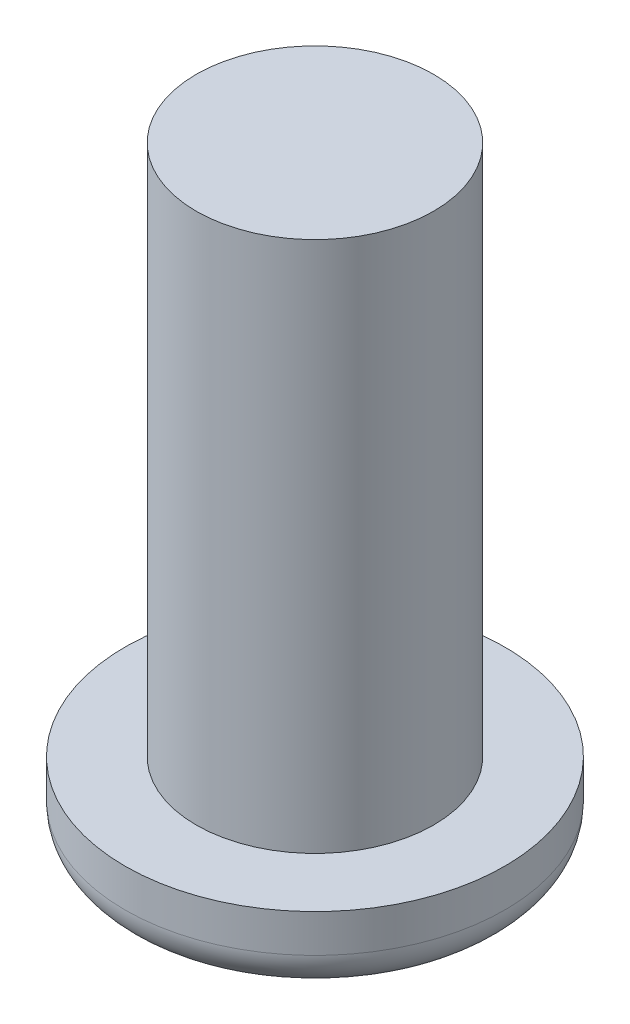
ISO-10303-21;
HEADER;
FILE_DESCRIPTION(('STEP AP214'),'2;1');
FILE_NAME('part.step','',(''),(''),'','','');
FILE_SCHEMA(('AUTOMOTIVE_DESIGN { 1 0 10303 214 1 1 1 1 }'));
ENDSEC;
DATA;
#1=APPLICATION_CONTEXT('core data for automotive mechanical design processes');
#2=APPLICATION_PROTOCOL_DEFINITION('international standard','automotive_design',2000,#1);
#3=PRODUCT_CONTEXT('',#1,'mechanical');
#4=PRODUCT('Part','Part','',(#3));
#5=PRODUCT_RELATED_PRODUCT_CATEGORY('part','',(#4));
#6=PRODUCT_DEFINITION_FORMATION('','',#4);
#7=PRODUCT_DEFINITION_CONTEXT('part definition',#1,'design');
#8=PRODUCT_DEFINITION('design','',#6,#7);
#9=PRODUCT_DEFINITION_SHAPE('','',#8);
#10=(LENGTH_UNIT() NAMED_UNIT(*) SI_UNIT(.MILLI.,.METRE.));
#11=(NAMED_UNIT(*) PLANE_ANGLE_UNIT() SI_UNIT($,.RADIAN.));
#12=(NAMED_UNIT(*) SI_UNIT($,.STERADIAN.) SOLID_ANGLE_UNIT());
#13=UNCERTAINTY_MEASURE_WITH_UNIT(LENGTH_MEASURE(1.E-05),#10,'distance_accuracy_value','');
#14=(GEOMETRIC_REPRESENTATION_CONTEXT(3) GLOBAL_UNCERTAINTY_ASSIGNED_CONTEXT((#13)) GLOBAL_UNIT_ASSIGNED_CONTEXT((#10,
#11,#12)) REPRESENTATION_CONTEXT('',''));
#15=CARTESIAN_POINT('',(0.,0.,0.));
#16=DIRECTION('',(0.,0.,1.));
#17=DIRECTION('',(1.,0.,0.));
#18=AXIS2_PLACEMENT_3D('',#15,#16,#17);
#19=CARTESIAN_POINT('',(0.,2.54,0.));
#20=DIRECTION('',(0.,-1.,0.));
#21=DIRECTION('',(0.,0.,-1.));
#22=AXIS2_PLACEMENT_3D('',#19,#20,#21);
#23=CYLINDRICAL_SURFACE('',#22,6.35);
#24=CARTESIAN_POINT('',(0.,1.27,0.));
#25=DIRECTION('',(0.,1.,0.));
#26=DIRECTION('',(0.,0.,1.));
#27=AXIS2_PLACEMENT_3D('',#24,#25,#26);
#28=CIRCLE('',#27,6.35);
#29=CARTESIAN_POINT('',(0.,1.27,6.35));
#30=VERTEX_POINT('',#29);
#31=EDGE_CURVE('E49',#30,#30,#28,.T.);
#32=ORIENTED_EDGE('',*,*,#31,.T.);
#33=EDGE_LOOP('',(#32));
#34=FACE_BOUND('',#33,.T.);
#35=CARTESIAN_POINT('',(0.,2.54,0.));
#36=DIRECTION('',(0.,1.,0.));
#37=DIRECTION('',(0.,0.,1.));
#38=AXIS2_PLACEMENT_3D('',#35,#36,#37);
#39=CIRCLE('',#38,6.35);
#40=CARTESIAN_POINT('',(0.,2.54,6.35));
#41=VERTEX_POINT('',#40);
#42=EDGE_CURVE('E53',#41,#41,#39,.T.);
#43=ORIENTED_EDGE('',*,*,#42,.F.);
#44=EDGE_LOOP('',(#43));
#45=FACE_BOUND('',#44,.T.);
#46=ADVANCED_FACE('F37',(#34,#45),#23,.T.);
#47=CARTESIAN_POINT('',(0.,2.54,0.));
#48=DIRECTION('',(0.,1.,0.));
#49=DIRECTION('',(0.,0.,1.));
#50=AXIS2_PLACEMENT_3D('',#47,#48,#49);
#51=PLANE('',#50);
#52=CARTESIAN_POINT('',(0.,2.54,0.));
#53=DIRECTION('',(0.,1.,0.));
#54=DIRECTION('',(0.,0.,1.));
#55=AXIS2_PLACEMENT_3D('',#52,#53,#54);
#56=CIRCLE('',#55,3.96875);
#57=CARTESIAN_POINT('',(0.,2.54,3.96875));
#58=VERTEX_POINT('',#57);
#59=EDGE_CURVE('E10',#58,#58,#56,.T.);
#60=ORIENTED_EDGE('',*,*,#59,.F.);
#61=EDGE_LOOP('',(#60));
#62=FACE_BOUND('',#61,.T.);
#63=ORIENTED_EDGE('',*,*,#42,.T.);
#64=EDGE_LOOP('',(#63));
#65=FACE_BOUND('',#64,.T.);
#66=ADVANCED_FACE('F72',(#62,#65),#51,.T.);
#67=CARTESIAN_POINT('',(0.,0.,0.));
#68=DIRECTION('',(0.,1.,0.));
#69=DIRECTION('',(0.,0.,1.));
#70=AXIS2_PLACEMENT_3D('',#67,#68,#69);
#71=PLANE('',#70);
#72=CARTESIAN_POINT('',(0.,0.,0.));
#73=DIRECTION('',(0.,1.,0.));
#74=DIRECTION('',(0.,0.,1.));
#75=AXIS2_PLACEMENT_3D('',#72,#73,#74);
#76=CIRCLE('',#75,5.08);
#77=CARTESIAN_POINT('',(0.,0.,5.08));
#78=VERTEX_POINT('',#77);
#79=EDGE_CURVE('E41',#78,#78,#76,.F.);
#80=ORIENTED_EDGE('',*,*,#79,.T.);
#81=EDGE_LOOP('',(#80));
#82=FACE_BOUND('',#81,.T.);
#83=ADVANCED_FACE('F62',(#82),#71,.F.);
#84=CARTESIAN_POINT('',(0.,1.27,0.));
#85=DIRECTION('',(0.,1.,0.));
#86=DIRECTION('',(0.,0.,1.));
#87=AXIS2_PLACEMENT_3D('',#84,#85,#86);
#88=TOROIDAL_SURFACE('',#87,5.08,1.27);
#89=ORIENTED_EDGE('',*,*,#79,.F.);
#90=EDGE_LOOP('',(#89));
#91=FACE_BOUND('',#90,.T.);
#92=ORIENTED_EDGE('',*,*,#31,.F.);
#93=EDGE_LOOP('',(#92));
#94=FACE_BOUND('',#93,.T.);
#95=ADVANCED_FACE('F39',(#91,#94),#88,.T.);
#96=CARTESIAN_POINT('',(0.,20.32,0.));
#97=DIRECTION('',(0.,-1.,0.));
#98=DIRECTION('',(0.,0.,-1.));
#99=AXIS2_PLACEMENT_3D('',#96,#97,#98);
#100=CYLINDRICAL_SURFACE('',#99,3.96875);
#101=CARTESIAN_POINT('',(0.,20.32,0.));
#102=DIRECTION('',(0.,1.,0.));
#103=DIRECTION('',(0.,0.,1.));
#104=AXIS2_PLACEMENT_3D('',#101,#102,#103);
#105=CIRCLE('',#104,3.96875);
#106=CARTESIAN_POINT('',(0.,20.32,3.96875));
#107=VERTEX_POINT('',#106);
#108=EDGE_CURVE('E52',#107,#107,#105,.T.);
#109=ORIENTED_EDGE('',*,*,#108,.F.);
#110=EDGE_LOOP('',(#109));
#111=FACE_BOUND('',#110,.T.);
#112=ORIENTED_EDGE('',*,*,#59,.T.);
#113=EDGE_LOOP('',(#112));
#114=FACE_BOUND('',#113,.T.);
#115=ADVANCED_FACE('F61',(#111,#114),#100,.T.);
#116=CARTESIAN_POINT('',(0.,20.32,0.));
#117=DIRECTION('',(0.,1.,0.));
#118=DIRECTION('',(0.,0.,1.));
#119=AXIS2_PLACEMENT_3D('',#116,#117,#118);
#120=PLANE('',#119);
#121=ORIENTED_EDGE('',*,*,#108,.T.);
#122=EDGE_LOOP('',(#121));
#123=FACE_BOUND('',#122,.T.);
#124=ADVANCED_FACE('F69',(#123),#120,.T.);
#125=CLOSED_SHELL('',(#46,#66,#83,#95,#115,#124));
#126=MANIFOLD_SOLID_BREP('B2',#125);
#127=ADVANCED_BREP_SHAPE_REPRESENTATION('',(#18,#126),#14);
#128=SHAPE_DEFINITION_REPRESENTATION(#9,#127);
ENDSEC;
END-ISO-10303-21;
